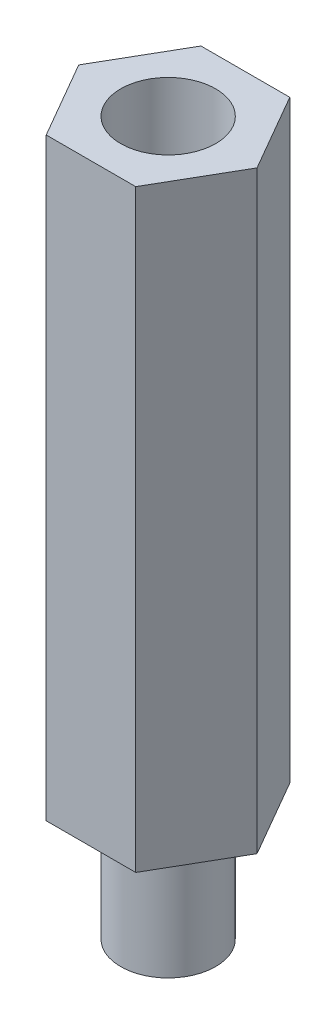
ISO-10303-21;
HEADER;
FILE_DESCRIPTION(('STEP AP214'),'2;1');
FILE_NAME('part.step','',(''),(''),'','','');
FILE_SCHEMA(('AUTOMOTIVE_DESIGN { 1 0 10303 214 1 1 1 1 }'));
ENDSEC;
DATA;
#1=APPLICATION_CONTEXT('core data for automotive mechanical design processes');
#2=APPLICATION_PROTOCOL_DEFINITION('international standard','automotive_design',2000,#1);
#3=PRODUCT_CONTEXT('',#1,'mechanical');
#4=PRODUCT('Part','Part','',(#3));
#5=PRODUCT_RELATED_PRODUCT_CATEGORY('part','',(#4));
#6=PRODUCT_DEFINITION_FORMATION('','',#4);
#7=PRODUCT_DEFINITION_CONTEXT('part definition',#1,'design');
#8=PRODUCT_DEFINITION('design','',#6,#7);
#9=PRODUCT_DEFINITION_SHAPE('','',#8);
#10=(LENGTH_UNIT() NAMED_UNIT(*) SI_UNIT(.MILLI.,.METRE.));
#11=(NAMED_UNIT(*) PLANE_ANGLE_UNIT() SI_UNIT($,.RADIAN.));
#12=(NAMED_UNIT(*) SI_UNIT($,.STERADIAN.) SOLID_ANGLE_UNIT());
#13=UNCERTAINTY_MEASURE_WITH_UNIT(LENGTH_MEASURE(1.E-05),#10,'distance_accuracy_value','');
#14=(GEOMETRIC_REPRESENTATION_CONTEXT(3) GLOBAL_UNCERTAINTY_ASSIGNED_CONTEXT((#13)) GLOBAL_UNIT_ASSIGNED_CONTEXT((#10,
#11,#12)) REPRESENTATION_CONTEXT('',''));
#15=CARTESIAN_POINT('',(0.,0.,0.));
#16=DIRECTION('',(0.,0.,1.));
#17=DIRECTION('',(1.,0.,0.));
#18=AXIS2_PLACEMENT_3D('',#15,#16,#17);
#19=CARTESIAN_POINT('',(0.696402345828869,-10.,2.50919117647076));
#20=DIRECTION('',(0.,1.,0.));
#21=DIRECTION('',(0.,0.,1.));
#22=AXIS2_PLACEMENT_3D('',#19,#20,#21);
#23=CYLINDRICAL_SURFACE('',#22,4.);
#24=CARTESIAN_POINT('',(0.696402345828869,-10.,2.50919117647076));
#25=DIRECTION('',(0.,-1.,0.));
#26=DIRECTION('',(0.,0.,-1.));
#27=AXIS2_PLACEMENT_3D('',#24,#25,#26);
#28=CIRCLE('',#27,4.);
#29=CARTESIAN_POINT('',(0.696402345828869,-10.,-1.49080882352924));
#30=VERTEX_POINT('',#29);
#31=EDGE_CURVE('E11',#30,#30,#28,.T.);
#32=ORIENTED_EDGE('',*,*,#31,.F.);
#33=EDGE_LOOP('',(#32));
#34=FACE_BOUND('',#33,.T.);
#35=CARTESIAN_POINT('',(0.696402345828869,0.,2.50919117647076));
#36=DIRECTION('',(0.,-1.,0.));
#37=DIRECTION('',(0.,0.,-1.));
#38=AXIS2_PLACEMENT_3D('',#35,#36,#37);
#39=CIRCLE('',#38,4.);
#40=CARTESIAN_POINT('',(0.696402345828869,0.,-1.49080882352924));
#41=VERTEX_POINT('',#40);
#42=EDGE_CURVE('E50',#41,#41,#39,.T.);
#43=ORIENTED_EDGE('',*,*,#42,.T.);
#44=EDGE_LOOP('',(#43));
#45=FACE_BOUND('',#44,.T.);
#46=ADVANCED_FACE('F47',(#34,#45),#23,.T.);
#47=CARTESIAN_POINT('',(0.696402345828869,-10.,2.50919117647076));
#48=DIRECTION('',(0.,-1.,0.));
#49=DIRECTION('',(0.,0.,-1.));
#50=AXIS2_PLACEMENT_3D('',#47,#48,#49);
#51=PLANE('',#50);
#52=ORIENTED_EDGE('',*,*,#31,.T.);
#53=EDGE_LOOP('',(#52));
#54=FACE_BOUND('',#53,.T.);
#55=ADVANCED_FACE('F62',(#54),#51,.T.);
#56=CARTESIAN_POINT('',(0.696402345828869,0.,2.50919117647076));
#57=DIRECTION('',(0.,-1.,0.));
#58=DIRECTION('',(0.,0.,-1.));
#59=AXIS2_PLACEMENT_3D('',#56,#57,#58);
#60=PLANE('',#59);
#61=ORIENTED_EDGE('',*,*,#42,.F.);
#62=EDGE_LOOP('',(#61));
#63=FACE_BOUND('',#62,.T.);
#64=ADVANCED_FACE('F60',(#63),#60,.F.);
#65=CLOSED_SHELL('',(#46,#55,#64));
#66=MANIFOLD_SOLID_BREP('B2',#65);
#67=CARTESIAN_POINT('',(0.,50.,0.));
#68=DIRECTION('',(0.,-1.,0.));
#69=DIRECTION('',(0.,0.,-1.));
#70=AXIS2_PLACEMENT_3D('',#67,#68,#69);
#71=PLANE('',#70);
#72=DIRECTION('',(-0.499999999999998,0.,0.86602540378444));
#73=VECTOR('',#72,1.);
#74=CARTESIAN_POINT('',(-6.80915115363614,50.,2.53424423270764));
#75=LINE('',#74,#73);
#76=CARTESIAN_POINT('',(-3.04191001514123,50.,-3.99080882352921));
#77=VERTEX_POINT('',#76);
#78=CARTESIAN_POINT('',(-6.80915115363614,50.,2.53424423270764));
#79=VERTEX_POINT('',#78);
#80=EDGE_CURVE('E195',#77,#79,#75,.T.);
#81=ORIENTED_EDGE('',*,*,#80,.T.);
#82=DIRECTION('',(0.500000000000003,0.,0.866025403784437));
#83=VECTOR('',#82,1.);
#84=CARTESIAN_POINT('',(-3.0708387926659,50.,9.00919117647079));
#85=LINE('',#84,#83);
#86=CARTESIAN_POINT('',(-3.0708387926659,50.,9.00919117647079));
#87=VERTEX_POINT('',#86);
#88=EDGE_CURVE('E143',#79,#87,#85,.T.);
#89=ORIENTED_EDGE('',*,*,#88,.T.);
#90=DIRECTION('',(1.,0.,0.));
#91=VECTOR('',#90,1.);
#92=CARTESIAN_POINT('',(4.46364348432393,50.,9.00919117647079));
#93=LINE('',#92,#91);
#94=CARTESIAN_POINT('',(4.46364348432393,50.,9.00919117647079));
#95=VERTEX_POINT('',#94);
#96=EDGE_CURVE('E156',#87,#95,#93,.T.);
#97=ORIENTED_EDGE('',*,*,#96,.T.);
#98=DIRECTION('',(0.499999999999998,0.,-0.86602540378444));
#99=VECTOR('',#98,1.);
#100=CARTESIAN_POINT('',(8.20195584529414,50.,2.53424423270759));
#101=LINE('',#100,#99);
#102=CARTESIAN_POINT('',(8.20195584529414,50.,2.53424423270759));
#103=VERTEX_POINT('',#102);
#104=EDGE_CURVE('E150',#95,#103,#101,.T.);
#105=ORIENTED_EDGE('',*,*,#104,.T.);
#106=DIRECTION('',(-0.50000000000001,0.,-0.866025403784433));
#107=VECTOR('',#106,1.);
#108=CARTESIAN_POINT('',(4.43471470679909,50.,-3.99080882352927));
#109=LINE('',#108,#107);
#110=CARTESIAN_POINT('',(4.43471470679909,50.,-3.99080882352927));
#111=VERTEX_POINT('',#110);
#112=EDGE_CURVE('E154',#103,#111,#109,.T.);
#113=ORIENTED_EDGE('',*,*,#112,.T.);
#114=DIRECTION('',(-1.,0.,0.));
#115=VECTOR('',#114,1.);
#116=CARTESIAN_POINT('',(-3.04191001514123,50.,-3.99080882352921));
#117=LINE('',#116,#115);
#118=EDGE_CURVE('E106',#111,#77,#117,.T.);
#119=ORIENTED_EDGE('',*,*,#118,.T.);
#120=EDGE_LOOP('',(#81,#89,#97,#105,#113,#119));
#121=FACE_BOUND('',#120,.T.);
#122=CARTESIAN_POINT('',(0.696402345828869,50.,2.50919117647076));
#123=DIRECTION('',(0.,1.,0.));
#124=DIRECTION('',(0.,0.,1.));
#125=AXIS2_PLACEMENT_3D('',#122,#123,#124);
#126=CIRCLE('',#125,4.);
#127=CARTESIAN_POINT('',(0.696402345828869,50.,6.50919117647076));
#128=VERTEX_POINT('',#127);
#129=EDGE_CURVE('E183',#128,#128,#126,.T.);
#130=ORIENTED_EDGE('',*,*,#129,.F.);
#131=EDGE_LOOP('',(#130));
#132=FACE_BOUND('',#131,.T.);
#133=ADVANCED_FACE('F88',(#121,#132),#71,.F.);
#134=CARTESIAN_POINT('',(0.,0.,0.));
#135=DIRECTION('',(0.,-1.,0.));
#136=DIRECTION('',(0.,0.,-1.));
#137=AXIS2_PLACEMENT_3D('',#134,#135,#136);
#138=PLANE('',#137);
#139=DIRECTION('',(-0.499999999999998,0.,0.86602540378444));
#140=VECTOR('',#139,1.);
#141=CARTESIAN_POINT('',(-6.80915115363614,0.,2.53424423270764));
#142=LINE('',#141,#140);
#143=CARTESIAN_POINT('',(-3.04191001514123,0.,-3.99080882352921));
#144=VERTEX_POINT('',#143);
#145=CARTESIAN_POINT('',(-6.80915115363614,0.,2.53424423270764));
#146=VERTEX_POINT('',#145);
#147=EDGE_CURVE('E178',#144,#146,#142,.T.);
#148=ORIENTED_EDGE('',*,*,#147,.F.);
#149=DIRECTION('',(-1.,0.,0.));
#150=VECTOR('',#149,1.);
#151=CARTESIAN_POINT('',(-3.04191001514123,0.,-3.99080882352921));
#152=LINE('',#151,#150);
#153=CARTESIAN_POINT('',(4.43471470679909,0.,-3.99080882352927));
#154=VERTEX_POINT('',#153);
#155=EDGE_CURVE('E135',#154,#144,#152,.T.);
#156=ORIENTED_EDGE('',*,*,#155,.F.);
#157=DIRECTION('',(-0.50000000000001,0.,-0.866025403784433));
#158=VECTOR('',#157,1.);
#159=CARTESIAN_POINT('',(4.43471470679909,0.,-3.99080882352927));
#160=LINE('',#159,#158);
#161=CARTESIAN_POINT('',(8.20195584529414,0.,2.53424423270759));
#162=VERTEX_POINT('',#161);
#163=EDGE_CURVE('E129',#162,#154,#160,.T.);
#164=ORIENTED_EDGE('',*,*,#163,.F.);
#165=DIRECTION('',(0.499999999999998,0.,-0.86602540378444));
#166=VECTOR('',#165,1.);
#167=CARTESIAN_POINT('',(8.20195584529414,0.,2.53424423270759));
#168=LINE('',#167,#166);
#169=CARTESIAN_POINT('',(4.46364348432393,0.,9.00919117647079));
#170=VERTEX_POINT('',#169);
#171=EDGE_CURVE('E165',#170,#162,#168,.T.);
#172=ORIENTED_EDGE('',*,*,#171,.F.);
#173=DIRECTION('',(1.,0.,0.));
#174=VECTOR('',#173,1.);
#175=CARTESIAN_POINT('',(4.46364348432393,0.,9.00919117647079));
#176=LINE('',#175,#174);
#177=CARTESIAN_POINT('',(-3.0708387926659,0.,9.00919117647079));
#178=VERTEX_POINT('',#177);
#179=EDGE_CURVE('E186',#178,#170,#176,.T.);
#180=ORIENTED_EDGE('',*,*,#179,.F.);
#181=DIRECTION('',(0.500000000000003,0.,0.866025403784437));
#182=VECTOR('',#181,1.);
#183=CARTESIAN_POINT('',(-3.0708387926659,0.,9.00919117647079));
#184=LINE('',#183,#182);
#185=EDGE_CURVE('E182',#146,#178,#184,.T.);
#186=ORIENTED_EDGE('',*,*,#185,.F.);
#187=EDGE_LOOP('',(#148,#156,#164,#172,#180,#186));
#188=FACE_BOUND('',#187,.T.);
#189=CARTESIAN_POINT('',(0.696402345828869,0.,2.50919117647076));
#190=DIRECTION('',(0.,1.,0.));
#191=DIRECTION('',(0.,0.,1.));
#192=AXIS2_PLACEMENT_3D('',#189,#190,#191);
#193=CIRCLE('',#192,4.);
#194=CARTESIAN_POINT('',(0.696402345828869,0.,6.50919117647076));
#195=VERTEX_POINT('',#194);
#196=EDGE_CURVE('E292',#195,#195,#193,.T.);
#197=ORIENTED_EDGE('',*,*,#196,.T.);
#198=EDGE_LOOP('',(#197));
#199=FACE_BOUND('',#198,.T.);
#200=ADVANCED_FACE('F208',(#188,#199),#138,.T.);
#201=CARTESIAN_POINT('',(-6.80915115363614,50.,2.53424423270764));
#202=DIRECTION('',(0.86602540378444,0.,0.499999999999998));
#203=DIRECTION('',(0.499999999999998,0.,-0.86602540378444));
#204=AXIS2_PLACEMENT_3D('',#201,#202,#203);
#205=PLANE('',#204);
#206=ORIENTED_EDGE('',*,*,#147,.T.);
#207=DIRECTION('',(0.,-1.,0.));
#208=VECTOR('',#207,1.);
#209=CARTESIAN_POINT('',(-6.80915115363614,50.,2.53424423270764));
#210=LINE('',#209,#208);
#211=EDGE_CURVE('E45',#79,#146,#210,.T.);
#212=ORIENTED_EDGE('',*,*,#211,.F.);
#213=ORIENTED_EDGE('',*,*,#80,.F.);
#214=DIRECTION('',(0.,-1.,0.));
#215=VECTOR('',#214,1.);
#216=CARTESIAN_POINT('',(-3.04191001514123,50.,-3.99080882352921));
#217=LINE('',#216,#215);
#218=EDGE_CURVE('E174',#77,#144,#217,.T.);
#219=ORIENTED_EDGE('',*,*,#218,.T.);
#220=EDGE_LOOP('',(#206,#212,#213,#219));
#221=FACE_BOUND('',#220,.T.);
#222=ADVANCED_FACE('F90',(#221),#205,.F.);
#223=CARTESIAN_POINT('',(-3.0708387926659,50.,9.00919117647079));
#224=DIRECTION('',(0.866025403784437,0.,-0.500000000000003));
#225=DIRECTION('',(-0.500000000000003,0.,-0.866025403784437));
#226=AXIS2_PLACEMENT_3D('',#223,#224,#225);
#227=PLANE('',#226);
#228=ORIENTED_EDGE('',*,*,#185,.T.);
#229=DIRECTION('',(0.,-1.,0.));
#230=VECTOR('',#229,1.);
#231=CARTESIAN_POINT('',(-3.0708387926659,50.,9.00919117647079));
#232=LINE('',#231,#230);
#233=EDGE_CURVE('E98',#87,#178,#232,.T.);
#234=ORIENTED_EDGE('',*,*,#233,.F.);
#235=ORIENTED_EDGE('',*,*,#88,.F.);
#236=ORIENTED_EDGE('',*,*,#211,.T.);
#237=EDGE_LOOP('',(#228,#234,#235,#236));
#238=FACE_BOUND('',#237,.T.);
#239=ADVANCED_FACE('F233',(#238),#227,.F.);
#240=CARTESIAN_POINT('',(4.46364348432393,50.,9.00919117647079));
#241=DIRECTION('',(0.,0.,-1.));
#242=DIRECTION('',(-1.,0.,0.));
#243=AXIS2_PLACEMENT_3D('',#240,#241,#242);
#244=PLANE('',#243);
#245=ORIENTED_EDGE('',*,*,#179,.T.);
#246=DIRECTION('',(0.,-1.,0.));
#247=VECTOR('',#246,1.);
#248=CARTESIAN_POINT('',(4.46364348432393,50.,9.00919117647079));
#249=LINE('',#248,#247);
#250=EDGE_CURVE('E167',#95,#170,#249,.T.);
#251=ORIENTED_EDGE('',*,*,#250,.F.);
#252=ORIENTED_EDGE('',*,*,#96,.F.);
#253=ORIENTED_EDGE('',*,*,#233,.T.);
#254=EDGE_LOOP('',(#245,#251,#252,#253));
#255=FACE_BOUND('',#254,.T.);
#256=ADVANCED_FACE('F205',(#255),#244,.F.);
#257=CARTESIAN_POINT('',(8.20195584529414,50.,2.53424423270759));
#258=DIRECTION('',(-0.86602540378444,0.,-0.499999999999998));
#259=DIRECTION('',(-0.499999999999998,0.,0.86602540378444));
#260=AXIS2_PLACEMENT_3D('',#257,#258,#259);
#261=PLANE('',#260);
#262=ORIENTED_EDGE('',*,*,#171,.T.);
#263=DIRECTION('',(0.,-1.,0.));
#264=VECTOR('',#263,1.);
#265=CARTESIAN_POINT('',(8.20195584529414,50.,2.53424423270759));
#266=LINE('',#265,#264);
#267=EDGE_CURVE('E162',#103,#162,#266,.T.);
#268=ORIENTED_EDGE('',*,*,#267,.F.);
#269=ORIENTED_EDGE('',*,*,#104,.F.);
#270=ORIENTED_EDGE('',*,*,#250,.T.);
#271=EDGE_LOOP('',(#262,#268,#269,#270));
#272=FACE_BOUND('',#271,.T.);
#273=ADVANCED_FACE('F163',(#272),#261,.F.);
#274=CARTESIAN_POINT('',(4.43471470679909,50.,-3.99080882352927));
#275=DIRECTION('',(-0.866025403784433,0.,0.50000000000001));
#276=DIRECTION('',(0.50000000000001,0.,0.866025403784433));
#277=AXIS2_PLACEMENT_3D('',#274,#275,#276);
#278=PLANE('',#277);
#279=ORIENTED_EDGE('',*,*,#163,.T.);
#280=DIRECTION('',(0.,-1.,0.));
#281=VECTOR('',#280,1.);
#282=CARTESIAN_POINT('',(4.43471470679909,50.,-3.99080882352927));
#283=LINE('',#282,#281);
#284=EDGE_CURVE('E168',#111,#154,#283,.T.);
#285=ORIENTED_EDGE('',*,*,#284,.F.);
#286=ORIENTED_EDGE('',*,*,#112,.F.);
#287=ORIENTED_EDGE('',*,*,#267,.T.);
#288=EDGE_LOOP('',(#279,#285,#286,#287));
#289=FACE_BOUND('',#288,.T.);
#290=ADVANCED_FACE('F170',(#289),#278,.F.);
#291=CARTESIAN_POINT('',(-3.04191001514123,50.,-3.99080882352921));
#292=DIRECTION('',(0.,0.,1.));
#293=DIRECTION('',(1.,0.,0.));
#294=AXIS2_PLACEMENT_3D('',#291,#292,#293);
#295=PLANE('',#294);
#296=ORIENTED_EDGE('',*,*,#155,.T.);
#297=ORIENTED_EDGE('',*,*,#218,.F.);
#298=ORIENTED_EDGE('',*,*,#118,.F.);
#299=ORIENTED_EDGE('',*,*,#284,.T.);
#300=EDGE_LOOP('',(#296,#297,#298,#299));
#301=FACE_BOUND('',#300,.T.);
#302=ADVANCED_FACE('F213',(#301),#295,.F.);
#303=CARTESIAN_POINT('',(0.696402345828869,50.,2.50919117647076));
#304=DIRECTION('',(0.,-1.,0.));
#305=DIRECTION('',(0.,0.,-1.));
#306=AXIS2_PLACEMENT_3D('',#303,#304,#305);
#307=CYLINDRICAL_SURFACE('',#306,4.);
#308=ORIENTED_EDGE('',*,*,#129,.T.);
#309=EDGE_LOOP('',(#308));
#310=FACE_BOUND('',#309,.T.);
#311=ORIENTED_EDGE('',*,*,#196,.F.);
#312=EDGE_LOOP('',(#311));
#313=FACE_BOUND('',#312,.T.);
#314=ADVANCED_FACE('F215',(#310,#313),#307,.F.);
#315=CLOSED_SHELL('',(#133,#200,#222,#239,#256,#273,#290,#302,#314));
#316=MANIFOLD_SOLID_BREP('B6',#315);
#317=ADVANCED_BREP_SHAPE_REPRESENTATION('',(#18,#66,#316),#14);
#318=SHAPE_DEFINITION_REPRESENTATION(#9,#317);
ENDSEC;
END-ISO-10303-21;
